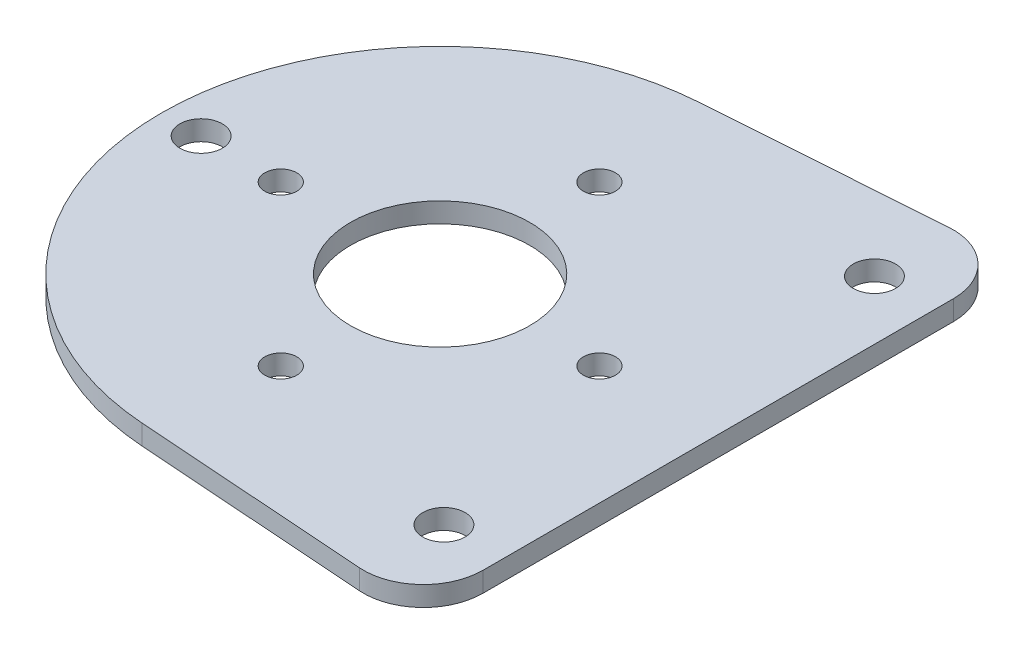
ISO-10303-21;
HEADER;
FILE_DESCRIPTION(('STEP AP214'),'2;1');
FILE_NAME('part.step','',(''),(''),'','','');
FILE_SCHEMA(('AUTOMOTIVE_DESIGN { 1 0 10303 214 1 1 1 1 }'));
ENDSEC;
DATA;
#1=APPLICATION_CONTEXT('core data for automotive mechanical design processes');
#2=APPLICATION_PROTOCOL_DEFINITION('international standard','automotive_design',2000,#1);
#3=PRODUCT_CONTEXT('',#1,'mechanical');
#4=PRODUCT('Part','Part','',(#3));
#5=PRODUCT_RELATED_PRODUCT_CATEGORY('part','',(#4));
#6=PRODUCT_DEFINITION_FORMATION('','',#4);
#7=PRODUCT_DEFINITION_CONTEXT('part definition',#1,'design');
#8=PRODUCT_DEFINITION('design','',#6,#7);
#9=PRODUCT_DEFINITION_SHAPE('','',#8);
#10=(LENGTH_UNIT() NAMED_UNIT(*) SI_UNIT(.MILLI.,.METRE.));
#11=(NAMED_UNIT(*) PLANE_ANGLE_UNIT() SI_UNIT($,.RADIAN.));
#12=(NAMED_UNIT(*) SI_UNIT($,.STERADIAN.) SOLID_ANGLE_UNIT());
#13=UNCERTAINTY_MEASURE_WITH_UNIT(LENGTH_MEASURE(1.E-05),#10,'distance_accuracy_value','');
#14=(GEOMETRIC_REPRESENTATION_CONTEXT(3) GLOBAL_UNCERTAINTY_ASSIGNED_CONTEXT((#13)) GLOBAL_UNIT_ASSIGNED_CONTEXT((#10,
#11,#12)) REPRESENTATION_CONTEXT('',''));
#15=CARTESIAN_POINT('',(0.,0.,0.));
#16=DIRECTION('',(0.,0.,1.));
#17=DIRECTION('',(1.,0.,0.));
#18=AXIS2_PLACEMENT_3D('',#15,#16,#17);
#19=CARTESIAN_POINT('',(89.48928,0.,0.));
#20=DIRECTION('',(0.,-1.,0.));
#21=DIRECTION('',(0.,0.,-1.));
#22=AXIS2_PLACEMENT_3D('',#19,#20,#21);
#23=PLANE('',#22);
#24=DIRECTION('',(-0.997479288528233,0.,0.0709582198001818));
#25=VECTOR('',#24,1.);
#26=CARTESIAN_POINT('',(85.8846024341508,0.,-50.6719478572342));
#27=LINE('',#26,#25);
#28=CARTESIAN_POINT('',(34.1221229564032,0.,-46.9896925578747));
#29=VERTEX_POINT('',#28);
#30=CARTESIAN_POINT('',(-3.15409287011808,0.,-44.3379543750799));
#31=VERTEX_POINT('',#30);
#32=EDGE_CURVE('E103',#29,#31,#27,.T.);
#33=ORIENTED_EDGE('',*,*,#32,.F.);
#34=CARTESIAN_POINT('',(34.798,0.,-37.4887023346433));
#35=DIRECTION('',(0.,-1.,0.));
#36=DIRECTION('',(0.,0.,-1.));
#37=AXIS2_PLACEMENT_3D('',#34,#35,#36);
#38=CIRCLE('',#37,9.525);
#39=CARTESIAN_POINT('',(44.323,0.,-37.4887023346433));
#40=VERTEX_POINT('',#39);
#41=EDGE_CURVE('E42',#29,#40,#38,.T.);
#42=ORIENTED_EDGE('',*,*,#41,.T.);
#43=DIRECTION('',(0.,0.,1.));
#44=VECTOR('',#43,1.);
#45=CARTESIAN_POINT('',(44.323,0.,47.7153578260551));
#46=LINE('',#45,#44);
#47=CARTESIAN_POINT('',(44.323,0.,37.4887023346433));
#48=VERTEX_POINT('',#47);
#49=EDGE_CURVE('E134',#40,#48,#46,.T.);
#50=ORIENTED_EDGE('',*,*,#49,.T.);
#51=CARTESIAN_POINT('',(34.798,0.,37.4887023346433));
#52=DIRECTION('',(0.,-1.,0.));
#53=DIRECTION('',(0.,0.,-1.));
#54=AXIS2_PLACEMENT_3D('',#51,#52,#53);
#55=CIRCLE('',#54,9.525);
#56=CARTESIAN_POINT('',(34.1221229564032,0.,46.9896925578747));
#57=VERTEX_POINT('',#56);
#58=EDGE_CURVE('E49',#48,#57,#55,.T.);
#59=ORIENTED_EDGE('',*,*,#58,.T.);
#60=DIRECTION('',(0.997479288528233,0.,0.0709582198001818));
#61=VECTOR('',#60,1.);
#62=CARTESIAN_POINT('',(85.8846024341508,0.,50.6719478572342));
#63=LINE('',#62,#61);
#64=CARTESIAN_POINT('',(-3.15409287011808,0.,44.3379543750799));
#65=VERTEX_POINT('',#64);
#66=EDGE_CURVE('E98',#65,#57,#63,.T.);
#67=ORIENTED_EDGE('',*,*,#66,.F.);
#68=CARTESIAN_POINT('',(0.,0.,0.));
#69=DIRECTION('',(0.,1.,0.));
#70=DIRECTION('',(0.,0.,1.));
#71=AXIS2_PLACEMENT_3D('',#68,#69,#70);
#72=CIRCLE('',#71,44.45);
#73=EDGE_CURVE('E118',#31,#65,#72,.T.);
#74=ORIENTED_EDGE('',*,*,#73,.F.);
#75=EDGE_LOOP('',(#33,#42,#50,#59,#67,#74));
#76=FACE_BOUND('',#75,.T.);
#77=CARTESIAN_POINT('',(0.,0.,0.));
#78=DIRECTION('',(0.,1.,0.));
#79=DIRECTION('',(0.,0.,1.));
#80=AXIS2_PLACEMENT_3D('',#77,#78,#79);
#81=CIRCLE('',#80,14.28115);
#82=CARTESIAN_POINT('',(0.,0.,14.28115));
#83=VERTEX_POINT('',#82);
#84=EDGE_CURVE('E337',#83,#83,#81,.T.);
#85=ORIENTED_EDGE('',*,*,#84,.T.);
#86=EDGE_LOOP('',(#85));
#87=FACE_BOUND('',#86,.T.);
#88=CARTESIAN_POINT('',(-25.4,0.,0.));
#89=DIRECTION('',(0.,1.,0.));
#90=DIRECTION('',(0.,0.,1.));
#91=AXIS2_PLACEMENT_3D('',#88,#89,#90);
#92=CIRCLE('',#91,2.5527);
#93=CARTESIAN_POINT('',(-25.4,0.,2.5527));
#94=VERTEX_POINT('',#93);
#95=EDGE_CURVE('E334',#94,#94,#92,.T.);
#96=ORIENTED_EDGE('',*,*,#95,.T.);
#97=EDGE_LOOP('',(#96));
#98=FACE_BOUND('',#97,.T.);
#99=CARTESIAN_POINT('',(0.,0.,25.4));
#100=DIRECTION('',(0.,1.,0.));
#101=DIRECTION('',(0.,0.,1.));
#102=AXIS2_PLACEMENT_3D('',#99,#100,#101);
#103=CIRCLE('',#102,2.5527);
#104=CARTESIAN_POINT('',(0.,0.,27.9527));
#105=VERTEX_POINT('',#104);
#106=EDGE_CURVE('E328',#105,#105,#103,.T.);
#107=ORIENTED_EDGE('',*,*,#106,.T.);
#108=EDGE_LOOP('',(#107));
#109=FACE_BOUND('',#108,.T.);
#110=CARTESIAN_POINT('',(25.4,0.,0.));
#111=DIRECTION('',(0.,1.,0.));
#112=DIRECTION('',(0.,0.,1.));
#113=AXIS2_PLACEMENT_3D('',#110,#111,#112);
#114=CIRCLE('',#113,2.5527);
#115=CARTESIAN_POINT('',(25.4,0.,2.5527));
#116=VERTEX_POINT('',#115);
#117=EDGE_CURVE('E322',#116,#116,#114,.T.);
#118=ORIENTED_EDGE('',*,*,#117,.T.);
#119=EDGE_LOOP('',(#118));
#120=FACE_BOUND('',#119,.T.);
#121=CARTESIAN_POINT('',(0.,0.,-25.4));
#122=DIRECTION('',(0.,1.,0.));
#123=DIRECTION('',(0.,0.,1.));
#124=AXIS2_PLACEMENT_3D('',#121,#122,#123);
#125=CIRCLE('',#124,2.5527);
#126=CARTESIAN_POINT('',(0.,0.,-22.8473));
#127=VERTEX_POINT('',#126);
#128=EDGE_CURVE('E316',#127,#127,#125,.T.);
#129=ORIENTED_EDGE('',*,*,#128,.T.);
#130=EDGE_LOOP('',(#129));
#131=FACE_BOUND('',#130,.T.);
#132=CARTESIAN_POINT('',(34.925,0.,34.3147133180326));
#133=DIRECTION('',(0.,1.,0.));
#134=DIRECTION('',(0.,0.,1.));
#135=AXIS2_PLACEMENT_3D('',#132,#133,#134);
#136=CIRCLE('',#135,3.3782);
#137=CARTESIAN_POINT('',(34.925,0.,37.6929133180326));
#138=VERTEX_POINT('',#137);
#139=EDGE_CURVE('E310',#138,#138,#136,.T.);
#140=ORIENTED_EDGE('',*,*,#139,.T.);
#141=EDGE_LOOP('',(#140));
#142=FACE_BOUND('',#141,.T.);
#143=CARTESIAN_POINT('',(34.925,0.,-34.3147133180325));
#144=DIRECTION('',(0.,1.,0.));
#145=DIRECTION('',(0.,0.,1.));
#146=AXIS2_PLACEMENT_3D('',#143,#144,#145);
#147=CIRCLE('',#146,3.3782);
#148=CARTESIAN_POINT('',(34.925,0.,-30.9365133180325));
#149=VERTEX_POINT('',#148);
#150=EDGE_CURVE('E304',#149,#149,#147,.T.);
#151=ORIENTED_EDGE('',*,*,#150,.T.);
#152=EDGE_LOOP('',(#151));
#153=FACE_BOUND('',#152,.T.);
#154=CARTESIAN_POINT('',(-38.1,0.,0.));
#155=DIRECTION('',(0.,1.,0.));
#156=DIRECTION('',(0.,0.,1.));
#157=AXIS2_PLACEMENT_3D('',#154,#155,#156);
#158=CIRCLE('',#157,3.3782);
#159=CARTESIAN_POINT('',(-38.1,0.,3.37820000000002));
#160=VERTEX_POINT('',#159);
#161=EDGE_CURVE('E294',#160,#160,#158,.T.);
#162=ORIENTED_EDGE('',*,*,#161,.T.);
#163=EDGE_LOOP('',(#162));
#164=FACE_BOUND('',#163,.T.);
#165=ADVANCED_FACE('F34',(#76,#87,#98,#109,#120,#131,#142,#153,#164),#23,.T.);
#166=CARTESIAN_POINT('',(89.48928,3.175,0.));
#167=DIRECTION('',(0.,-1.,0.));
#168=DIRECTION('',(0.,0.,-1.));
#169=AXIS2_PLACEMENT_3D('',#166,#167,#168);
#170=PLANE('',#169);
#171=CARTESIAN_POINT('',(-38.1,3.175,0.));
#172=DIRECTION('',(0.,1.,0.));
#173=DIRECTION('',(0.,0.,1.));
#174=AXIS2_PLACEMENT_3D('',#171,#172,#173);
#175=CIRCLE('',#174,3.3782);
#176=CARTESIAN_POINT('',(-38.1,3.175,3.37820000000002));
#177=VERTEX_POINT('',#176);
#178=EDGE_CURVE('E141',#177,#177,#175,.T.);
#179=ORIENTED_EDGE('',*,*,#178,.F.);
#180=EDGE_LOOP('',(#179));
#181=FACE_BOUND('',#180,.T.);
#182=CARTESIAN_POINT('',(34.925,3.175,-34.3147133180325));
#183=DIRECTION('',(0.,1.,0.));
#184=DIRECTION('',(0.,0.,1.));
#185=AXIS2_PLACEMENT_3D('',#182,#183,#184);
#186=CIRCLE('',#185,3.3782);
#187=CARTESIAN_POINT('',(34.925,3.175,-30.9365133180325));
#188=VERTEX_POINT('',#187);
#189=EDGE_CURVE('E298',#188,#188,#186,.T.);
#190=ORIENTED_EDGE('',*,*,#189,.F.);
#191=EDGE_LOOP('',(#190));
#192=FACE_BOUND('',#191,.T.);
#193=CARTESIAN_POINT('',(34.925,3.175,34.3147133180326));
#194=DIRECTION('',(0.,1.,0.));
#195=DIRECTION('',(0.,0.,1.));
#196=AXIS2_PLACEMENT_3D('',#193,#194,#195);
#197=CIRCLE('',#196,3.3782);
#198=CARTESIAN_POINT('',(34.925,3.175,37.6929133180326));
#199=VERTEX_POINT('',#198);
#200=EDGE_CURVE('E307',#199,#199,#197,.T.);
#201=ORIENTED_EDGE('',*,*,#200,.F.);
#202=EDGE_LOOP('',(#201));
#203=FACE_BOUND('',#202,.T.);
#204=CARTESIAN_POINT('',(0.,3.175,-25.4));
#205=DIRECTION('',(0.,1.,0.));
#206=DIRECTION('',(0.,0.,1.));
#207=AXIS2_PLACEMENT_3D('',#204,#205,#206);
#208=CIRCLE('',#207,2.5527);
#209=CARTESIAN_POINT('',(0.,3.175,-22.8473));
#210=VERTEX_POINT('',#209);
#211=EDGE_CURVE('E313',#210,#210,#208,.T.);
#212=ORIENTED_EDGE('',*,*,#211,.F.);
#213=EDGE_LOOP('',(#212));
#214=FACE_BOUND('',#213,.T.);
#215=CARTESIAN_POINT('',(25.4,3.175,0.));
#216=DIRECTION('',(0.,1.,0.));
#217=DIRECTION('',(0.,0.,1.));
#218=AXIS2_PLACEMENT_3D('',#215,#216,#217);
#219=CIRCLE('',#218,2.5527);
#220=CARTESIAN_POINT('',(25.4,3.175,2.55270000000001));
#221=VERTEX_POINT('',#220);
#222=EDGE_CURVE('E319',#221,#221,#219,.T.);
#223=ORIENTED_EDGE('',*,*,#222,.F.);
#224=EDGE_LOOP('',(#223));
#225=FACE_BOUND('',#224,.T.);
#226=CARTESIAN_POINT('',(0.,3.175,25.4));
#227=DIRECTION('',(0.,1.,0.));
#228=DIRECTION('',(0.,0.,1.));
#229=AXIS2_PLACEMENT_3D('',#226,#227,#228);
#230=CIRCLE('',#229,2.5527);
#231=CARTESIAN_POINT('',(0.,3.175,27.9527));
#232=VERTEX_POINT('',#231);
#233=EDGE_CURVE('E325',#232,#232,#230,.T.);
#234=ORIENTED_EDGE('',*,*,#233,.F.);
#235=EDGE_LOOP('',(#234));
#236=FACE_BOUND('',#235,.T.);
#237=CARTESIAN_POINT('',(-25.4,3.175,0.));
#238=DIRECTION('',(0.,1.,0.));
#239=DIRECTION('',(0.,0.,1.));
#240=AXIS2_PLACEMENT_3D('',#237,#238,#239);
#241=CIRCLE('',#240,2.5527);
#242=CARTESIAN_POINT('',(-25.4,3.175,2.55270000000001));
#243=VERTEX_POINT('',#242);
#244=EDGE_CURVE('E331',#243,#243,#241,.T.);
#245=ORIENTED_EDGE('',*,*,#244,.F.);
#246=EDGE_LOOP('',(#245));
#247=FACE_BOUND('',#246,.T.);
#248=DIRECTION('',(0.,0.,1.));
#249=VECTOR('',#248,1.);
#250=CARTESIAN_POINT('',(44.323,3.175,47.7153578260551));
#251=LINE('',#250,#249);
#252=CARTESIAN_POINT('',(44.323,3.175,-37.4887023346433));
#253=VERTEX_POINT('',#252);
#254=CARTESIAN_POINT('',(44.323,3.175,37.4887023346433));
#255=VERTEX_POINT('',#254);
#256=EDGE_CURVE('E142',#253,#255,#251,.T.);
#257=ORIENTED_EDGE('',*,*,#256,.F.);
#258=CARTESIAN_POINT('',(34.798,3.175,-37.4887023346433));
#259=DIRECTION('',(0.,-1.,0.));
#260=DIRECTION('',(0.,0.,-1.));
#261=AXIS2_PLACEMENT_3D('',#258,#259,#260);
#262=CIRCLE('',#261,9.525);
#263=CARTESIAN_POINT('',(34.1221229564032,3.175,-46.9896925578747));
#264=VERTEX_POINT('',#263);
#265=EDGE_CURVE('E97',#253,#264,#262,.F.);
#266=ORIENTED_EDGE('',*,*,#265,.T.);
#267=DIRECTION('',(-0.997479288528233,0.,0.0709582198001818));
#268=VECTOR('',#267,1.);
#269=CARTESIAN_POINT('',(85.8846024341508,3.175,-50.6719478572342));
#270=LINE('',#269,#268);
#271=CARTESIAN_POINT('',(-3.15409287011808,3.175,-44.3379543750799));
#272=VERTEX_POINT('',#271);
#273=EDGE_CURVE('E88',#264,#272,#270,.T.);
#274=ORIENTED_EDGE('',*,*,#273,.T.);
#275=CARTESIAN_POINT('',(0.,3.175,0.));
#276=DIRECTION('',(0.,1.,0.));
#277=DIRECTION('',(0.,0.,1.));
#278=AXIS2_PLACEMENT_3D('',#275,#276,#277);
#279=CIRCLE('',#278,44.45);
#280=CARTESIAN_POINT('',(-3.15409287011808,3.175,44.3379543750799));
#281=VERTEX_POINT('',#280);
#282=EDGE_CURVE('E95',#272,#281,#279,.T.);
#283=ORIENTED_EDGE('',*,*,#282,.T.);
#284=DIRECTION('',(0.997479288528233,0.,0.0709582198001818));
#285=VECTOR('',#284,1.);
#286=CARTESIAN_POINT('',(85.8846024341508,3.175,50.6719478572342));
#287=LINE('',#286,#285);
#288=CARTESIAN_POINT('',(34.1221229564032,3.175,46.9896925578747));
#289=VERTEX_POINT('',#288);
#290=EDGE_CURVE('E112',#281,#289,#287,.T.);
#291=ORIENTED_EDGE('',*,*,#290,.T.);
#292=CARTESIAN_POINT('',(34.798,3.175,37.4887023346433));
#293=DIRECTION('',(0.,-1.,0.));
#294=DIRECTION('',(0.,0.,-1.));
#295=AXIS2_PLACEMENT_3D('',#292,#293,#294);
#296=CIRCLE('',#295,9.525);
#297=EDGE_CURVE('E127',#289,#255,#296,.F.);
#298=ORIENTED_EDGE('',*,*,#297,.T.);
#299=EDGE_LOOP('',(#257,#266,#274,#283,#291,#298));
#300=FACE_BOUND('',#299,.T.);
#301=CARTESIAN_POINT('',(0.,3.175,0.));
#302=DIRECTION('',(0.,1.,0.));
#303=DIRECTION('',(0.,0.,1.));
#304=AXIS2_PLACEMENT_3D('',#301,#302,#303);
#305=CIRCLE('',#304,14.28115);
#306=CARTESIAN_POINT('',(0.,3.175,14.28115));
#307=VERTEX_POINT('',#306);
#308=EDGE_CURVE('E119',#307,#307,#305,.T.);
#309=ORIENTED_EDGE('',*,*,#308,.F.);
#310=EDGE_LOOP('',(#309));
#311=FACE_BOUND('',#310,.T.);
#312=ADVANCED_FACE('F91',(#181,#192,#203,#214,#225,#236,#247,#300,#311),#170,.F.);
#313=CARTESIAN_POINT('',(85.8846024341508,3.175,-50.6719478572342));
#314=DIRECTION('',(0.0709582198001818,0.,0.997479288528233));
#315=DIRECTION('',(0.997479288528233,0.,-0.0709582198001818));
#316=AXIS2_PLACEMENT_3D('',#313,#314,#315);
#317=PLANE('',#316);
#318=ORIENTED_EDGE('',*,*,#273,.F.);
#319=DIRECTION('',(0.,1.,0.));
#320=VECTOR('',#319,1.);
#321=CARTESIAN_POINT('',(34.1221229564033,3.175,-46.9896925578747));
#322=LINE('',#321,#320);
#323=EDGE_CURVE('E57',#264,#29,#322,.F.);
#324=ORIENTED_EDGE('',*,*,#323,.T.);
#325=ORIENTED_EDGE('',*,*,#32,.T.);
#326=DIRECTION('',(0.,-1.,0.));
#327=VECTOR('',#326,1.);
#328=CARTESIAN_POINT('',(-3.15409287011808,3.175,-44.3379543750799));
#329=LINE('',#328,#327);
#330=EDGE_CURVE('E101',#272,#31,#329,.T.);
#331=ORIENTED_EDGE('',*,*,#330,.F.);
#332=EDGE_LOOP('',(#318,#324,#325,#331));
#333=FACE_BOUND('',#332,.T.);
#334=ADVANCED_FACE('F102',(#333),#317,.F.);
#335=CARTESIAN_POINT('',(0.,3.175,0.));
#336=DIRECTION('',(0.,-1.,0.));
#337=DIRECTION('',(0.,0.,-1.));
#338=AXIS2_PLACEMENT_3D('',#335,#336,#337);
#339=CYLINDRICAL_SURFACE('',#338,44.45);
#340=ORIENTED_EDGE('',*,*,#73,.T.);
#341=DIRECTION('',(0.,-1.,0.));
#342=VECTOR('',#341,1.);
#343=CARTESIAN_POINT('',(-3.15409287011808,3.175,44.3379543750799));
#344=LINE('',#343,#342);
#345=EDGE_CURVE('E107',#281,#65,#344,.T.);
#346=ORIENTED_EDGE('',*,*,#345,.F.);
#347=ORIENTED_EDGE('',*,*,#282,.F.);
#348=ORIENTED_EDGE('',*,*,#330,.T.);
#349=EDGE_LOOP('',(#340,#346,#347,#348));
#350=FACE_BOUND('',#349,.T.);
#351=ADVANCED_FACE('F109',(#350),#339,.T.);
#352=CARTESIAN_POINT('',(85.8846024341508,3.175,50.6719478572342));
#353=DIRECTION('',(0.0709582198001818,0.,-0.997479288528233));
#354=DIRECTION('',(-0.997479288528233,0.,-0.0709582198001818));
#355=AXIS2_PLACEMENT_3D('',#352,#353,#354);
#356=PLANE('',#355);
#357=ORIENTED_EDGE('',*,*,#66,.T.);
#358=DIRECTION('',(0.,1.,0.));
#359=VECTOR('',#358,1.);
#360=CARTESIAN_POINT('',(34.1221229564033,3.175,46.9896925578747));
#361=LINE('',#360,#359);
#362=EDGE_CURVE('E11',#57,#289,#361,.T.);
#363=ORIENTED_EDGE('',*,*,#362,.T.);
#364=ORIENTED_EDGE('',*,*,#290,.F.);
#365=ORIENTED_EDGE('',*,*,#345,.T.);
#366=EDGE_LOOP('',(#357,#363,#364,#365));
#367=FACE_BOUND('',#366,.T.);
#368=ADVANCED_FACE('F163',(#367),#356,.F.);
#369=CARTESIAN_POINT('',(0.,3.175,0.));
#370=DIRECTION('',(0.,-1.,0.));
#371=DIRECTION('',(0.,0.,-1.));
#372=AXIS2_PLACEMENT_3D('',#369,#370,#371);
#373=CYLINDRICAL_SURFACE('',#372,14.28115);
#374=ORIENTED_EDGE('',*,*,#308,.T.);
#375=EDGE_LOOP('',(#374));
#376=FACE_BOUND('',#375,.T.);
#377=ORIENTED_EDGE('',*,*,#84,.F.);
#378=EDGE_LOOP('',(#377));
#379=FACE_BOUND('',#378,.T.);
#380=ADVANCED_FACE('F166',(#376,#379),#373,.F.);
#381=CARTESIAN_POINT('',(-25.4,3.175,0.));
#382=DIRECTION('',(0.,1.,0.));
#383=DIRECTION('',(0.,0.,1.));
#384=AXIS2_PLACEMENT_3D('',#381,#382,#383);
#385=CYLINDRICAL_SURFACE('',#384,2.5527);
#386=ORIENTED_EDGE('',*,*,#95,.F.);
#387=EDGE_LOOP('',(#386));
#388=FACE_BOUND('',#387,.T.);
#389=ORIENTED_EDGE('',*,*,#244,.T.);
#390=EDGE_LOOP('',(#389));
#391=FACE_BOUND('',#390,.T.);
#392=ADVANCED_FACE('F189',(#388,#391),#385,.F.);
#393=CARTESIAN_POINT('',(0.,3.175,25.4));
#394=DIRECTION('',(0.,1.,0.));
#395=DIRECTION('',(0.,0.,1.));
#396=AXIS2_PLACEMENT_3D('',#393,#394,#395);
#397=CYLINDRICAL_SURFACE('',#396,2.5527);
#398=ORIENTED_EDGE('',*,*,#106,.F.);
#399=EDGE_LOOP('',(#398));
#400=FACE_BOUND('',#399,.T.);
#401=ORIENTED_EDGE('',*,*,#233,.T.);
#402=EDGE_LOOP('',(#401));
#403=FACE_BOUND('',#402,.T.);
#404=ADVANCED_FACE('F196',(#400,#403),#397,.F.);
#405=CARTESIAN_POINT('',(25.4,3.175,0.));
#406=DIRECTION('',(0.,1.,0.));
#407=DIRECTION('',(0.,0.,1.));
#408=AXIS2_PLACEMENT_3D('',#405,#406,#407);
#409=CYLINDRICAL_SURFACE('',#408,2.5527);
#410=ORIENTED_EDGE('',*,*,#117,.F.);
#411=EDGE_LOOP('',(#410));
#412=FACE_BOUND('',#411,.T.);
#413=ORIENTED_EDGE('',*,*,#222,.T.);
#414=EDGE_LOOP('',(#413));
#415=FACE_BOUND('',#414,.T.);
#416=ADVANCED_FACE('F204',(#412,#415),#409,.F.);
#417=CARTESIAN_POINT('',(0.,3.175,-25.4));
#418=DIRECTION('',(0.,1.,0.));
#419=DIRECTION('',(0.,0.,1.));
#420=AXIS2_PLACEMENT_3D('',#417,#418,#419);
#421=CYLINDRICAL_SURFACE('',#420,2.5527);
#422=ORIENTED_EDGE('',*,*,#128,.F.);
#423=EDGE_LOOP('',(#422));
#424=FACE_BOUND('',#423,.T.);
#425=ORIENTED_EDGE('',*,*,#211,.T.);
#426=EDGE_LOOP('',(#425));
#427=FACE_BOUND('',#426,.T.);
#428=ADVANCED_FACE('F212',(#424,#427),#421,.F.);
#429=CARTESIAN_POINT('',(34.925,3.175,34.3147133180326));
#430=DIRECTION('',(0.,1.,0.));
#431=DIRECTION('',(0.,0.,1.));
#432=AXIS2_PLACEMENT_3D('',#429,#430,#431);
#433=CYLINDRICAL_SURFACE('',#432,3.3782);
#434=ORIENTED_EDGE('',*,*,#139,.F.);
#435=EDGE_LOOP('',(#434));
#436=FACE_BOUND('',#435,.T.);
#437=ORIENTED_EDGE('',*,*,#200,.T.);
#438=EDGE_LOOP('',(#437));
#439=FACE_BOUND('',#438,.T.);
#440=ADVANCED_FACE('F220',(#436,#439),#433,.F.);
#441=CARTESIAN_POINT('',(34.925,3.175,-34.3147133180325));
#442=DIRECTION('',(0.,1.,0.));
#443=DIRECTION('',(0.,0.,1.));
#444=AXIS2_PLACEMENT_3D('',#441,#442,#443);
#445=CYLINDRICAL_SURFACE('',#444,3.3782);
#446=ORIENTED_EDGE('',*,*,#150,.F.);
#447=EDGE_LOOP('',(#446));
#448=FACE_BOUND('',#447,.T.);
#449=ORIENTED_EDGE('',*,*,#189,.T.);
#450=EDGE_LOOP('',(#449));
#451=FACE_BOUND('',#450,.T.);
#452=ADVANCED_FACE('F228',(#448,#451),#445,.F.);
#453=CARTESIAN_POINT('',(-38.1,3.175,0.));
#454=DIRECTION('',(0.,1.,0.));
#455=DIRECTION('',(0.,0.,1.));
#456=AXIS2_PLACEMENT_3D('',#453,#454,#455);
#457=CYLINDRICAL_SURFACE('',#456,3.3782);
#458=ORIENTED_EDGE('',*,*,#161,.F.);
#459=EDGE_LOOP('',(#458));
#460=FACE_BOUND('',#459,.T.);
#461=ORIENTED_EDGE('',*,*,#178,.T.);
#462=EDGE_LOOP('',(#461));
#463=FACE_BOUND('',#462,.T.);
#464=ADVANCED_FACE('F151',(#460,#463),#457,.F.);
#465=CARTESIAN_POINT('',(44.323,0.,47.7153578260551));
#466=DIRECTION('',(-1.,0.,0.));
#467=DIRECTION('',(0.,0.,1.));
#468=AXIS2_PLACEMENT_3D('',#465,#466,#467);
#469=PLANE('',#468);
#470=ORIENTED_EDGE('',*,*,#49,.F.);
#471=DIRECTION('',(0.,1.,0.));
#472=VECTOR('',#471,1.);
#473=CARTESIAN_POINT('',(44.323,0.,-37.4887023346433));
#474=LINE('',#473,#472);
#475=EDGE_CURVE('E124',#40,#253,#474,.T.);
#476=ORIENTED_EDGE('',*,*,#475,.T.);
#477=ORIENTED_EDGE('',*,*,#256,.T.);
#478=DIRECTION('',(0.,1.,0.));
#479=VECTOR('',#478,1.);
#480=CARTESIAN_POINT('',(44.323,0.,37.4887023346433));
#481=LINE('',#480,#479);
#482=EDGE_CURVE('E106',#255,#48,#481,.F.);
#483=ORIENTED_EDGE('',*,*,#482,.T.);
#484=EDGE_LOOP('',(#470,#476,#477,#483));
#485=FACE_BOUND('',#484,.T.);
#486=ADVANCED_FACE('F138',(#485),#469,.F.);
#487=CARTESIAN_POINT('',(34.798,0.,-37.4887023346433));
#488=DIRECTION('',(0.,1.,0.));
#489=DIRECTION('',(0.,0.,1.));
#490=AXIS2_PLACEMENT_3D('',#487,#488,#489);
#491=CYLINDRICAL_SURFACE('',#490,9.525);
#492=ORIENTED_EDGE('',*,*,#41,.F.);
#493=ORIENTED_EDGE('',*,*,#323,.F.);
#494=ORIENTED_EDGE('',*,*,#265,.F.);
#495=ORIENTED_EDGE('',*,*,#475,.F.);
#496=EDGE_LOOP('',(#492,#493,#494,#495));
#497=FACE_BOUND('',#496,.T.);
#498=ADVANCED_FACE('F144',(#497),#491,.T.);
#499=CARTESIAN_POINT('',(34.798,3.175,37.4887023346433));
#500=DIRECTION('',(0.,1.,0.));
#501=DIRECTION('',(0.,0.,1.));
#502=AXIS2_PLACEMENT_3D('',#499,#500,#501);
#503=CYLINDRICAL_SURFACE('',#502,9.525);
#504=ORIENTED_EDGE('',*,*,#58,.F.);
#505=ORIENTED_EDGE('',*,*,#482,.F.);
#506=ORIENTED_EDGE('',*,*,#297,.F.);
#507=ORIENTED_EDGE('',*,*,#362,.F.);
#508=EDGE_LOOP('',(#504,#505,#506,#507));
#509=FACE_BOUND('',#508,.T.);
#510=ADVANCED_FACE('F36',(#509),#503,.T.);
#511=CLOSED_SHELL('',(#165,#312,#334,#351,#368,#380,#392,#404,#416,#428,#440,#452,#464,#486,
#498,#510));
#512=MANIFOLD_SOLID_BREP('B2',#511);
#513=ADVANCED_BREP_SHAPE_REPRESENTATION('',(#18,#512),#14);
#514=SHAPE_DEFINITION_REPRESENTATION(#9,#513);
ENDSEC;
END-ISO-10303-21;
